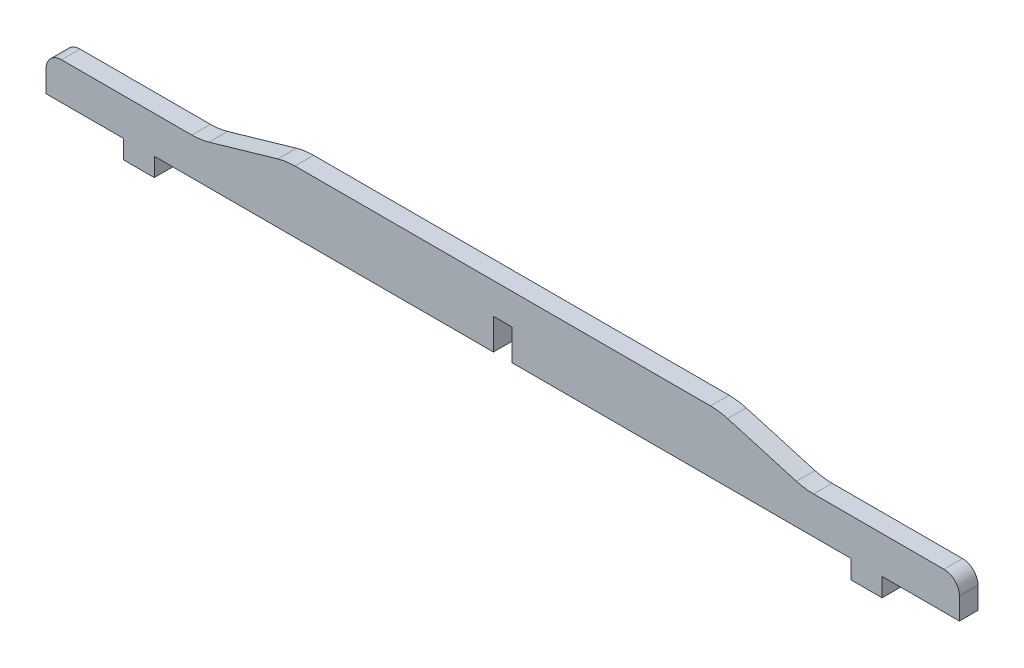
ISO-10303-21;
HEADER;
FILE_DESCRIPTION(('STEP AP214'),'2;1');
FILE_NAME('part.step','',(''),(''),'','','');
FILE_SCHEMA(('AUTOMOTIVE_DESIGN { 1 0 10303 214 1 1 1 1 }'));
ENDSEC;
DATA;
#1=APPLICATION_CONTEXT('core data for automotive mechanical design processes');
#2=APPLICATION_PROTOCOL_DEFINITION('international standard','automotive_design',2000,#1);
#3=PRODUCT_CONTEXT('',#1,'mechanical');
#4=PRODUCT('Part','Part','',(#3));
#5=PRODUCT_RELATED_PRODUCT_CATEGORY('part','',(#4));
#6=PRODUCT_DEFINITION_FORMATION('','',#4);
#7=PRODUCT_DEFINITION_CONTEXT('part definition',#1,'design');
#8=PRODUCT_DEFINITION('design','',#6,#7);
#9=PRODUCT_DEFINITION_SHAPE('','',#8);
#10=(LENGTH_UNIT() NAMED_UNIT(*) SI_UNIT(.MILLI.,.METRE.));
#11=(NAMED_UNIT(*) PLANE_ANGLE_UNIT() SI_UNIT($,.RADIAN.));
#12=(NAMED_UNIT(*) SI_UNIT($,.STERADIAN.) SOLID_ANGLE_UNIT());
#13=UNCERTAINTY_MEASURE_WITH_UNIT(LENGTH_MEASURE(1.E-05),#10,'distance_accuracy_value','');
#14=(GEOMETRIC_REPRESENTATION_CONTEXT(3) GLOBAL_UNCERTAINTY_ASSIGNED_CONTEXT((#13)) GLOBAL_UNIT_ASSIGNED_CONTEXT((#10,
#11,#12)) REPRESENTATION_CONTEXT('',''));
#15=CARTESIAN_POINT('',(0.,0.,0.));
#16=DIRECTION('',(0.,0.,1.));
#17=DIRECTION('',(1.,0.,0.));
#18=AXIS2_PLACEMENT_3D('',#15,#16,#17);
#19=CARTESIAN_POINT('',(112.66666667,-20.,6.));
#20=DIRECTION('',(0.,1.,0.));
#21=DIRECTION('',(0.,0.,1.));
#22=AXIS2_PLACEMENT_3D('',#19,#20,#21);
#23=PLANE('',#22);
#24=DIRECTION('',(1.,0.,0.));
#25=VECTOR('',#24,1.);
#26=CARTESIAN_POINT('',(112.66666667,-20.,0.));
#27=LINE('',#26,#25);
#28=CARTESIAN_POINT('',(-112.66666667,-20.,0.));
#29=VERTEX_POINT('',#28);
#30=CARTESIAN_POINT('',(-3.,-20.,0.));
#31=VERTEX_POINT('',#30);
#32=EDGE_CURVE('E228',#29,#31,#27,.T.);
#33=ORIENTED_EDGE('',*,*,#32,.T.);
#34=DIRECTION('',(0.,0.,1.));
#35=VECTOR('',#34,1.);
#36=CARTESIAN_POINT('',(-3.,-20.,0.));
#37=LINE('',#36,#35);
#38=CARTESIAN_POINT('',(-3.,-20.,6.));
#39=VERTEX_POINT('',#38);
#40=EDGE_CURVE('E211',#31,#39,#37,.T.);
#41=ORIENTED_EDGE('',*,*,#40,.T.);
#42=DIRECTION('',(1.,0.,0.));
#43=VECTOR('',#42,1.);
#44=CARTESIAN_POINT('',(112.66666667,-20.,6.));
#45=LINE('',#44,#43);
#46=CARTESIAN_POINT('',(-112.66666667,-20.,6.));
#47=VERTEX_POINT('',#46);
#48=EDGE_CURVE('E362',#47,#39,#45,.T.);
#49=ORIENTED_EDGE('',*,*,#48,.F.);
#50=DIRECTION('',(0.,0.,-1.));
#51=VECTOR('',#50,1.);
#52=CARTESIAN_POINT('',(-112.66666667,-20.,6.));
#53=LINE('',#52,#51);
#54=EDGE_CURVE('E234',#47,#29,#53,.T.);
#55=ORIENTED_EDGE('',*,*,#54,.T.);
#56=EDGE_LOOP('',(#33,#41,#49,#55));
#57=FACE_BOUND('',#56,.T.);
#58=ADVANCED_FACE('F38',(#57),#23,.F.);
#59=CARTESIAN_POINT('',(122.66666667,-26.,6.));
#60=DIRECTION('',(-1.,0.,0.));
#61=DIRECTION('',(0.,0.,1.));
#62=AXIS2_PLACEMENT_3D('',#59,#60,#61);
#63=PLANE('',#62);
#64=DIRECTION('',(0.,1.,0.));
#65=VECTOR('',#64,1.);
#66=CARTESIAN_POINT('',(122.66666667,-26.,0.));
#67=LINE('',#66,#65);
#68=CARTESIAN_POINT('',(122.66666667,-26.,0.));
#69=VERTEX_POINT('',#68);
#70=CARTESIAN_POINT('',(122.66666667,-20.,0.));
#71=VERTEX_POINT('',#70);
#72=EDGE_CURVE('E367',#69,#71,#67,.T.);
#73=ORIENTED_EDGE('',*,*,#72,.T.);
#74=DIRECTION('',(0.,0.,-1.));
#75=VECTOR('',#74,1.);
#76=CARTESIAN_POINT('',(122.66666667,-20.,6.));
#77=LINE('',#76,#75);
#78=CARTESIAN_POINT('',(122.66666667,-20.,6.));
#79=VERTEX_POINT('',#78);
#80=EDGE_CURVE('E272',#79,#71,#77,.T.);
#81=ORIENTED_EDGE('',*,*,#80,.F.);
#82=DIRECTION('',(0.,1.,0.));
#83=VECTOR('',#82,1.);
#84=CARTESIAN_POINT('',(122.66666667,-26.,6.));
#85=LINE('',#84,#83);
#86=CARTESIAN_POINT('',(122.66666667,-26.,6.));
#87=VERTEX_POINT('',#86);
#88=EDGE_CURVE('E245',#87,#79,#85,.T.);
#89=ORIENTED_EDGE('',*,*,#88,.F.);
#90=DIRECTION('',(0.,0.,-1.));
#91=VECTOR('',#90,1.);
#92=CARTESIAN_POINT('',(122.66666667,-26.,6.));
#93=LINE('',#92,#91);
#94=EDGE_CURVE('E246',#87,#69,#93,.T.);
#95=ORIENTED_EDGE('',*,*,#94,.T.);
#96=EDGE_LOOP('',(#73,#81,#89,#95));
#97=FACE_BOUND('',#96,.T.);
#98=ADVANCED_FACE('F431',(#97),#63,.F.);
#99=CARTESIAN_POINT('',(147.66666667,-20.,6.));
#100=DIRECTION('',(0.,1.,0.));
#101=DIRECTION('',(0.,0.,1.));
#102=AXIS2_PLACEMENT_3D('',#99,#100,#101);
#103=PLANE('',#102);
#104=DIRECTION('',(1.,0.,0.));
#105=VECTOR('',#104,1.);
#106=CARTESIAN_POINT('',(147.66666667,-20.,0.));
#107=LINE('',#106,#105);
#108=CARTESIAN_POINT('',(147.66666667,-20.,0.));
#109=VERTEX_POINT('',#108);
#110=EDGE_CURVE('E370',#71,#109,#107,.T.);
#111=ORIENTED_EDGE('',*,*,#110,.T.);
#112=DIRECTION('',(0.,0.,-1.));
#113=VECTOR('',#112,1.);
#114=CARTESIAN_POINT('',(147.66666667,-20.,6.));
#115=LINE('',#114,#113);
#116=CARTESIAN_POINT('',(147.66666667,-20.,6.));
#117=VERTEX_POINT('',#116);
#118=EDGE_CURVE('E269',#117,#109,#115,.T.);
#119=ORIENTED_EDGE('',*,*,#118,.F.);
#120=DIRECTION('',(1.,0.,0.));
#121=VECTOR('',#120,1.);
#122=CARTESIAN_POINT('',(147.66666667,-20.,6.));
#123=LINE('',#122,#121);
#124=EDGE_CURVE('E472',#79,#117,#123,.T.);
#125=ORIENTED_EDGE('',*,*,#124,.F.);
#126=ORIENTED_EDGE('',*,*,#80,.T.);
#127=EDGE_LOOP('',(#111,#119,#125,#126));
#128=FACE_BOUND('',#127,.T.);
#129=ADVANCED_FACE('F437',(#128),#103,.F.);
#130=CARTESIAN_POINT('',(147.66666667,-8.00000000000002,6.));
#131=DIRECTION('',(-1.,0.,0.));
#132=DIRECTION('',(0.,-1.,0.));
#133=AXIS2_PLACEMENT_3D('',#130,#131,#132);
#134=PLANE('',#133);
#135=DIRECTION('',(0.,1.,0.));
#136=VECTOR('',#135,1.);
#137=CARTESIAN_POINT('',(147.66666667,-8.00000000000002,0.));
#138=LINE('',#137,#136);
#139=CARTESIAN_POINT('',(147.66666667,-13.,0.));
#140=VERTEX_POINT('',#139);
#141=EDGE_CURVE('E372',#109,#140,#138,.T.);
#142=ORIENTED_EDGE('',*,*,#141,.T.);
#143=DIRECTION('',(0.,0.,-1.));
#144=VECTOR('',#143,1.);
#145=CARTESIAN_POINT('',(147.66666667,-13.,6.));
#146=LINE('',#145,#144);
#147=CARTESIAN_POINT('',(147.66666667,-13.,6.));
#148=VERTEX_POINT('',#147);
#149=EDGE_CURVE('E283',#140,#148,#146,.F.);
#150=ORIENTED_EDGE('',*,*,#149,.T.);
#151=DIRECTION('',(0.,1.,0.));
#152=VECTOR('',#151,1.);
#153=CARTESIAN_POINT('',(147.66666667,-8.00000000000002,6.));
#154=LINE('',#153,#152);
#155=EDGE_CURVE('E474',#117,#148,#154,.T.);
#156=ORIENTED_EDGE('',*,*,#155,.F.);
#157=ORIENTED_EDGE('',*,*,#118,.T.);
#158=EDGE_LOOP('',(#142,#150,#156,#157));
#159=FACE_BOUND('',#158,.T.);
#160=ADVANCED_FACE('F511',(#159),#134,.F.);
#161=CARTESIAN_POINT('',(97.66666667,-8.00000000000002,6.));
#162=DIRECTION('',(0.,-1.,0.));
#163=DIRECTION('',(1.,0.,0.));
#164=AXIS2_PLACEMENT_3D('',#161,#162,#163);
#165=PLANE('',#164);
#166=DIRECTION('',(-1.,0.,0.));
#167=VECTOR('',#166,1.);
#168=CARTESIAN_POINT('',(97.66666667,-8.00000000000002,0.));
#169=LINE('',#168,#167);
#170=CARTESIAN_POINT('',(142.66666667,-8.00000000000002,0.));
#171=VERTEX_POINT('',#170);
#172=CARTESIAN_POINT('',(100.500192903982,-8.00000000000002,0.));
#173=VERTEX_POINT('',#172);
#174=EDGE_CURVE('E375',#171,#173,#169,.T.);
#175=ORIENTED_EDGE('',*,*,#174,.T.);
#176=DIRECTION('',(0.,0.,-1.));
#177=VECTOR('',#176,1.);
#178=CARTESIAN_POINT('',(100.500192903982,-8.00000000000002,6.));
#179=LINE('',#178,#177);
#180=CARTESIAN_POINT('',(100.500192903982,-8.00000000000002,6.));
#181=VERTEX_POINT('',#180);
#182=EDGE_CURVE('E300',#173,#181,#179,.F.);
#183=ORIENTED_EDGE('',*,*,#182,.T.);
#184=DIRECTION('',(-1.,0.,0.));
#185=VECTOR('',#184,1.);
#186=CARTESIAN_POINT('',(97.66666667,-8.00000000000002,6.));
#187=LINE('',#186,#185);
#188=CARTESIAN_POINT('',(142.66666667,-8.00000000000002,6.));
#189=VERTEX_POINT('',#188);
#190=EDGE_CURVE('E477',#189,#181,#187,.T.);
#191=ORIENTED_EDGE('',*,*,#190,.F.);
#192=DIRECTION('',(0.,0.,-1.));
#193=VECTOR('',#192,1.);
#194=CARTESIAN_POINT('',(142.66666667,-8.00000000000002,6.));
#195=LINE('',#194,#193);
#196=EDGE_CURVE('E275',#189,#171,#195,.T.);
#197=ORIENTED_EDGE('',*,*,#196,.T.);
#198=EDGE_LOOP('',(#175,#183,#191,#197));
#199=FACE_BOUND('',#198,.T.);
#200=ADVANCED_FACE('F504',(#199),#165,.F.);
#201=CARTESIAN_POINT('',(70.,0.,6.));
#202=DIRECTION('',(-0.277777033532158,-0.960645574414453,0.));
#203=DIRECTION('',(0.960645574414453,-0.277777033532158,0.));
#204=AXIS2_PLACEMENT_3D('',#201,#202,#203);
#205=PLANE('',#204);
#206=DIRECTION('',(-0.960645574414453,0.277777033532158,0.));
#207=VECTOR('',#206,1.);
#208=CARTESIAN_POINT('',(70.,0.,6.));
#209=LINE('',#208,#207);
#210=CARTESIAN_POINT('',(94.9446522333384,-7.21291148828908,6.));
#211=VERTEX_POINT('',#210);
#212=CARTESIAN_POINT('',(72.7220144366616,-0.787088511710961,6.));
#213=VERTEX_POINT('',#212);
#214=EDGE_CURVE('E480',#211,#213,#209,.T.);
#215=ORIENTED_EDGE('',*,*,#214,.F.);
#216=DIRECTION('',(0.,0.,-1.));
#217=VECTOR('',#216,1.);
#218=CARTESIAN_POINT('',(94.9446522333384,-7.21291148828908,0.));
#219=LINE('',#218,#217);
#220=CARTESIAN_POINT('',(94.9446522333384,-7.21291148828908,0.));
#221=VERTEX_POINT('',#220);
#222=EDGE_CURVE('E297',#211,#221,#219,.T.);
#223=ORIENTED_EDGE('',*,*,#222,.T.);
#224=DIRECTION('',(-0.960645574414453,0.277777033532158,0.));
#225=VECTOR('',#224,1.);
#226=CARTESIAN_POINT('',(70.,0.,0.));
#227=LINE('',#226,#225);
#228=CARTESIAN_POINT('',(72.7220144366616,-0.787088511710961,0.));
#229=VERTEX_POINT('',#228);
#230=EDGE_CURVE('E378',#221,#229,#227,.T.);
#231=ORIENTED_EDGE('',*,*,#230,.T.);
#232=DIRECTION('',(0.,0.,-1.));
#233=VECTOR('',#232,1.);
#234=CARTESIAN_POINT('',(72.7220144366616,-0.787088511710961,6.));
#235=LINE('',#234,#233);
#236=EDGE_CURVE('E295',#229,#213,#235,.F.);
#237=ORIENTED_EDGE('',*,*,#236,.T.);
#238=EDGE_LOOP('',(#215,#223,#231,#237));
#239=FACE_BOUND('',#238,.T.);
#240=ADVANCED_FACE('F498',(#239),#205,.F.);
#241=CARTESIAN_POINT('',(70.,0.,6.));
#242=DIRECTION('',(0.,-1.,0.));
#243=DIRECTION('',(0.,0.,-1.));
#244=AXIS2_PLACEMENT_3D('',#241,#242,#243);
#245=PLANE('',#244);
#246=DIRECTION('',(-1.,0.,0.));
#247=VECTOR('',#246,1.);
#248=CARTESIAN_POINT('',(70.,0.,6.));
#249=LINE('',#248,#247);
#250=CARTESIAN_POINT('',(67.1664737660185,0.,6.));
#251=VERTEX_POINT('',#250);
#252=CARTESIAN_POINT('',(-67.1664737660185,0.,6.));
#253=VERTEX_POINT('',#252);
#254=EDGE_CURVE('E350',#251,#253,#249,.T.);
#255=ORIENTED_EDGE('',*,*,#254,.F.);
#256=DIRECTION('',(0.,0.,-1.));
#257=VECTOR('',#256,1.);
#258=CARTESIAN_POINT('',(67.1664737660185,0.,6.));
#259=LINE('',#258,#257);
#260=CARTESIAN_POINT('',(67.1664737660185,0.,0.));
#261=VERTEX_POINT('',#260);
#262=EDGE_CURVE('E304',#251,#261,#259,.T.);
#263=ORIENTED_EDGE('',*,*,#262,.T.);
#264=DIRECTION('',(-1.,0.,0.));
#265=VECTOR('',#264,1.);
#266=CARTESIAN_POINT('',(70.,0.,0.));
#267=LINE('',#266,#265);
#268=CARTESIAN_POINT('',(-67.1664737660185,0.,0.));
#269=VERTEX_POINT('',#268);
#270=EDGE_CURVE('E338',#261,#269,#267,.T.);
#271=ORIENTED_EDGE('',*,*,#270,.T.);
#272=DIRECTION('',(0.,0.,-1.));
#273=VECTOR('',#272,1.);
#274=CARTESIAN_POINT('',(-67.1664737660185,0.,6.));
#275=LINE('',#274,#273);
#276=EDGE_CURVE('E302',#269,#253,#275,.F.);
#277=ORIENTED_EDGE('',*,*,#276,.T.);
#278=EDGE_LOOP('',(#255,#263,#271,#277));
#279=FACE_BOUND('',#278,.T.);
#280=ADVANCED_FACE('F492',(#279),#245,.F.);
#281=CARTESIAN_POINT('',(-97.66666667,-8.00000000000002,6.));
#282=DIRECTION('',(0.277777033532158,-0.960645574414453,0.));
#283=DIRECTION('',(0.960645574414453,0.277777033532158,0.));
#284=AXIS2_PLACEMENT_3D('',#281,#282,#283);
#285=PLANE('',#284);
#286=DIRECTION('',(-0.960645574414453,-0.277777033532158,0.));
#287=VECTOR('',#286,1.);
#288=CARTESIAN_POINT('',(-97.66666667,-8.00000000000002,6.));
#289=LINE('',#288,#287);
#290=CARTESIAN_POINT('',(-72.7220144366616,-0.787088511710957,6.));
#291=VERTEX_POINT('',#290);
#292=CARTESIAN_POINT('',(-94.9446522333383,-7.21291148828908,6.));
#293=VERTEX_POINT('',#292);
#294=EDGE_CURVE('E346',#291,#293,#289,.T.);
#295=ORIENTED_EDGE('',*,*,#294,.F.);
#296=DIRECTION('',(0.,0.,-1.));
#297=VECTOR('',#296,1.);
#298=CARTESIAN_POINT('',(-72.7220144366616,-0.787088511710958,6.));
#299=LINE('',#298,#297);
#300=CARTESIAN_POINT('',(-72.7220144366616,-0.787088511710957,0.));
#301=VERTEX_POINT('',#300);
#302=EDGE_CURVE('E317',#291,#301,#299,.T.);
#303=ORIENTED_EDGE('',*,*,#302,.T.);
#304=DIRECTION('',(-0.960645574414453,-0.277777033532158,0.));
#305=VECTOR('',#304,1.);
#306=CARTESIAN_POINT('',(-97.66666667,-8.00000000000002,0.));
#307=LINE('',#306,#305);
#308=CARTESIAN_POINT('',(-94.9446522333383,-7.21291148828908,0.));
#309=VERTEX_POINT('',#308);
#310=EDGE_CURVE('E329',#301,#309,#307,.T.);
#311=ORIENTED_EDGE('',*,*,#310,.T.);
#312=DIRECTION('',(0.,0.,-1.));
#313=VECTOR('',#312,1.);
#314=CARTESIAN_POINT('',(-94.9446522333383,-7.21291148828908,6.));
#315=LINE('',#314,#313);
#316=EDGE_CURVE('E315',#309,#293,#315,.F.);
#317=ORIENTED_EDGE('',*,*,#316,.T.);
#318=EDGE_LOOP('',(#295,#303,#311,#317));
#319=FACE_BOUND('',#318,.T.);
#320=ADVANCED_FACE('F336',(#319),#285,.F.);
#321=CARTESIAN_POINT('',(-147.66666667,-8.00000000000002,6.));
#322=DIRECTION('',(0.,-1.,0.));
#323=DIRECTION('',(1.,0.,0.));
#324=AXIS2_PLACEMENT_3D('',#321,#322,#323);
#325=PLANE('',#324);
#326=DIRECTION('',(-1.,0.,0.));
#327=VECTOR('',#326,1.);
#328=CARTESIAN_POINT('',(-147.66666667,-8.00000000000002,6.));
#329=LINE('',#328,#327);
#330=CARTESIAN_POINT('',(-100.500192903981,-8.00000000000002,6.));
#331=VERTEX_POINT('',#330);
#332=CARTESIAN_POINT('',(-142.66666667,-8.00000000000002,6.));
#333=VERTEX_POINT('',#332);
#334=EDGE_CURVE('E342',#331,#333,#329,.T.);
#335=ORIENTED_EDGE('',*,*,#334,.F.);
#336=DIRECTION('',(0.,0.,-1.));
#337=VECTOR('',#336,1.);
#338=CARTESIAN_POINT('',(-100.500192903981,-8.00000000000003,0.));
#339=LINE('',#338,#337);
#340=CARTESIAN_POINT('',(-100.500192903981,-8.00000000000002,0.));
#341=VERTEX_POINT('',#340);
#342=EDGE_CURVE('E320',#331,#341,#339,.T.);
#343=ORIENTED_EDGE('',*,*,#342,.T.);
#344=DIRECTION('',(-1.,0.,0.));
#345=VECTOR('',#344,1.);
#346=CARTESIAN_POINT('',(-147.66666667,-8.00000000000002,0.));
#347=LINE('',#346,#345);
#348=CARTESIAN_POINT('',(-142.66666667,-8.00000000000002,0.));
#349=VERTEX_POINT('',#348);
#350=EDGE_CURVE('E330',#341,#349,#347,.T.);
#351=ORIENTED_EDGE('',*,*,#350,.T.);
#352=DIRECTION('',(0.,0.,-1.));
#353=VECTOR('',#352,1.);
#354=CARTESIAN_POINT('',(-142.66666667,-8.00000000000002,6.));
#355=LINE('',#354,#353);
#356=EDGE_CURVE('E292',#349,#333,#355,.F.);
#357=ORIENTED_EDGE('',*,*,#356,.T.);
#358=EDGE_LOOP('',(#335,#343,#351,#357));
#359=FACE_BOUND('',#358,.T.);
#360=ADVANCED_FACE('F341',(#359),#325,.F.);
#361=CARTESIAN_POINT('',(-147.66666667,-20.,6.));
#362=DIRECTION('',(1.,0.,0.));
#363=DIRECTION('',(0.,1.,0.));
#364=AXIS2_PLACEMENT_3D('',#361,#362,#363);
#365=PLANE('',#364);
#366=DIRECTION('',(0.,-1.,0.));
#367=VECTOR('',#366,1.);
#368=CARTESIAN_POINT('',(-147.66666667,-20.,6.));
#369=LINE('',#368,#367);
#370=CARTESIAN_POINT('',(-147.66666667,-13.,6.));
#371=VERTEX_POINT('',#370);
#372=CARTESIAN_POINT('',(-147.66666667,-20.,6.));
#373=VERTEX_POINT('',#372);
#374=EDGE_CURVE('E345',#371,#373,#369,.T.);
#375=ORIENTED_EDGE('',*,*,#374,.F.);
#376=DIRECTION('',(0.,0.,-1.));
#377=VECTOR('',#376,1.);
#378=CARTESIAN_POINT('',(-147.66666667,-13.,6.));
#379=LINE('',#378,#377);
#380=CARTESIAN_POINT('',(-147.66666667,-13.,0.));
#381=VERTEX_POINT('',#380);
#382=EDGE_CURVE('E289',#371,#381,#379,.T.);
#383=ORIENTED_EDGE('',*,*,#382,.T.);
#384=DIRECTION('',(0.,-1.,0.));
#385=VECTOR('',#384,1.);
#386=CARTESIAN_POINT('',(-147.66666667,-20.,0.));
#387=LINE('',#386,#385);
#388=CARTESIAN_POINT('',(-147.66666667,-20.,0.));
#389=VERTEX_POINT('',#388);
#390=EDGE_CURVE('E384',#381,#389,#387,.T.);
#391=ORIENTED_EDGE('',*,*,#390,.T.);
#392=DIRECTION('',(0.,0.,-1.));
#393=VECTOR('',#392,1.);
#394=CARTESIAN_POINT('',(-147.66666667,-20.,6.));
#395=LINE('',#394,#393);
#396=EDGE_CURVE('E266',#373,#389,#395,.T.);
#397=ORIENTED_EDGE('',*,*,#396,.F.);
#398=EDGE_LOOP('',(#375,#383,#391,#397));
#399=FACE_BOUND('',#398,.T.);
#400=ADVANCED_FACE('F413',(#399),#365,.F.);
#401=CARTESIAN_POINT('',(-147.66666667,-20.,6.));
#402=DIRECTION('',(0.,1.,0.));
#403=DIRECTION('',(0.,0.,1.));
#404=AXIS2_PLACEMENT_3D('',#401,#402,#403);
#405=PLANE('',#404);
#406=DIRECTION('',(1.,0.,0.));
#407=VECTOR('',#406,1.);
#408=CARTESIAN_POINT('',(-147.66666667,-20.,0.));
#409=LINE('',#408,#407);
#410=CARTESIAN_POINT('',(-122.66666667,-20.,0.));
#411=VERTEX_POINT('',#410);
#412=EDGE_CURVE('E386',#389,#411,#409,.T.);
#413=ORIENTED_EDGE('',*,*,#412,.T.);
#414=DIRECTION('',(0.,0.,-1.));
#415=VECTOR('',#414,1.);
#416=CARTESIAN_POINT('',(-122.66666667,-20.,6.));
#417=LINE('',#416,#415);
#418=CARTESIAN_POINT('',(-122.66666667,-20.,6.));
#419=VERTEX_POINT('',#418);
#420=EDGE_CURVE('E263',#419,#411,#417,.T.);
#421=ORIENTED_EDGE('',*,*,#420,.F.);
#422=DIRECTION('',(1.,0.,0.));
#423=VECTOR('',#422,1.);
#424=CARTESIAN_POINT('',(-147.66666667,-20.,6.));
#425=LINE('',#424,#423);
#426=EDGE_CURVE('E348',#373,#419,#425,.T.);
#427=ORIENTED_EDGE('',*,*,#426,.F.);
#428=ORIENTED_EDGE('',*,*,#396,.T.);
#429=EDGE_LOOP('',(#413,#421,#427,#428));
#430=FACE_BOUND('',#429,.T.);
#431=ADVANCED_FACE('F411',(#430),#405,.F.);
#432=CARTESIAN_POINT('',(-122.66666667,-20.,6.));
#433=DIRECTION('',(1.,0.,0.));
#434=DIRECTION('',(0.,0.,-1.));
#435=AXIS2_PLACEMENT_3D('',#432,#433,#434);
#436=PLANE('',#435);
#437=DIRECTION('',(0.,-1.,0.));
#438=VECTOR('',#437,1.);
#439=CARTESIAN_POINT('',(-122.66666667,-20.,0.));
#440=LINE('',#439,#438);
#441=CARTESIAN_POINT('',(-122.66666667,-26.,0.));
#442=VERTEX_POINT('',#441);
#443=EDGE_CURVE('E388',#411,#442,#440,.T.);
#444=ORIENTED_EDGE('',*,*,#443,.T.);
#445=DIRECTION('',(0.,0.,-1.));
#446=VECTOR('',#445,1.);
#447=CARTESIAN_POINT('',(-122.66666667,-26.,6.));
#448=LINE('',#447,#446);
#449=CARTESIAN_POINT('',(-122.66666667,-26.,6.));
#450=VERTEX_POINT('',#449);
#451=EDGE_CURVE('E260',#450,#442,#448,.T.);
#452=ORIENTED_EDGE('',*,*,#451,.F.);
#453=DIRECTION('',(0.,-1.,0.));
#454=VECTOR('',#453,1.);
#455=CARTESIAN_POINT('',(-122.66666667,-20.,6.));
#456=LINE('',#455,#454);
#457=EDGE_CURVE('E355',#419,#450,#456,.T.);
#458=ORIENTED_EDGE('',*,*,#457,.F.);
#459=ORIENTED_EDGE('',*,*,#420,.T.);
#460=EDGE_LOOP('',(#444,#452,#458,#459));
#461=FACE_BOUND('',#460,.T.);
#462=ADVANCED_FACE('F401',(#461),#436,.F.);
#463=CARTESIAN_POINT('',(-122.66666667,-26.,6.));
#464=DIRECTION('',(0.,1.,0.));
#465=DIRECTION('',(0.,0.,1.));
#466=AXIS2_PLACEMENT_3D('',#463,#464,#465);
#467=PLANE('',#466);
#468=DIRECTION('',(1.,0.,0.));
#469=VECTOR('',#468,1.);
#470=CARTESIAN_POINT('',(-122.66666667,-26.,0.));
#471=LINE('',#470,#469);
#472=CARTESIAN_POINT('',(-112.66666667,-26.,0.));
#473=VERTEX_POINT('',#472);
#474=EDGE_CURVE('E389',#442,#473,#471,.T.);
#475=ORIENTED_EDGE('',*,*,#474,.T.);
#476=DIRECTION('',(0.,0.,-1.));
#477=VECTOR('',#476,1.);
#478=CARTESIAN_POINT('',(-112.66666667,-26.,6.));
#479=LINE('',#478,#477);
#480=CARTESIAN_POINT('',(-112.66666667,-26.,6.));
#481=VERTEX_POINT('',#480);
#482=EDGE_CURVE('E257',#481,#473,#479,.T.);
#483=ORIENTED_EDGE('',*,*,#482,.F.);
#484=DIRECTION('',(1.,0.,0.));
#485=VECTOR('',#484,1.);
#486=CARTESIAN_POINT('',(-122.66666667,-26.,6.));
#487=LINE('',#486,#485);
#488=EDGE_CURVE('E357',#450,#481,#487,.T.);
#489=ORIENTED_EDGE('',*,*,#488,.F.);
#490=ORIENTED_EDGE('',*,*,#451,.T.);
#491=EDGE_LOOP('',(#475,#483,#489,#490));
#492=FACE_BOUND('',#491,.T.);
#493=ADVANCED_FACE('F405',(#492),#467,.F.);
#494=CARTESIAN_POINT('',(-112.66666667,-26.,6.));
#495=DIRECTION('',(-1.,0.,0.));
#496=DIRECTION('',(0.,0.,1.));
#497=AXIS2_PLACEMENT_3D('',#494,#495,#496);
#498=PLANE('',#497);
#499=DIRECTION('',(0.,1.,0.));
#500=VECTOR('',#499,1.);
#501=CARTESIAN_POINT('',(-112.66666667,-26.,0.));
#502=LINE('',#501,#500);
#503=EDGE_CURVE('E240',#473,#29,#502,.T.);
#504=ORIENTED_EDGE('',*,*,#503,.T.);
#505=ORIENTED_EDGE('',*,*,#54,.F.);
#506=DIRECTION('',(0.,1.,0.));
#507=VECTOR('',#506,1.);
#508=CARTESIAN_POINT('',(-112.66666667,-26.,6.));
#509=LINE('',#508,#507);
#510=EDGE_CURVE('E359',#481,#47,#509,.T.);
#511=ORIENTED_EDGE('',*,*,#510,.F.);
#512=ORIENTED_EDGE('',*,*,#482,.T.);
#513=EDGE_LOOP('',(#504,#505,#511,#512));
#514=FACE_BOUND('',#513,.T.);
#515=ADVANCED_FACE('F394',(#514),#498,.F.);
#516=CARTESIAN_POINT('',(3.,-20.,6.));
#517=VERTEX_POINT('',#516);
#518=CARTESIAN_POINT('',(112.66666667,-20.,6.));
#519=VERTEX_POINT('',#518);
#520=EDGE_CURVE('E361',#517,#519,#45,.T.);
#521=ORIENTED_EDGE('',*,*,#520,.F.);
#522=DIRECTION('',(0.,0.,1.));
#523=VECTOR('',#522,1.);
#524=CARTESIAN_POINT('',(3.,-20.,0.));
#525=LINE('',#524,#523);
#526=CARTESIAN_POINT('',(3.,-20.,0.));
#527=VERTEX_POINT('',#526);
#528=EDGE_CURVE('E222',#527,#517,#525,.T.);
#529=ORIENTED_EDGE('',*,*,#528,.F.);
#530=CARTESIAN_POINT('',(112.66666667,-20.,0.));
#531=VERTEX_POINT('',#530);
#532=EDGE_CURVE('E236',#527,#531,#27,.T.);
#533=ORIENTED_EDGE('',*,*,#532,.T.);
#534=DIRECTION('',(0.,0.,-1.));
#535=VECTOR('',#534,1.);
#536=CARTESIAN_POINT('',(112.66666667,-20.,6.));
#537=LINE('',#536,#535);
#538=EDGE_CURVE('E253',#519,#531,#537,.T.);
#539=ORIENTED_EDGE('',*,*,#538,.F.);
#540=EDGE_LOOP('',(#521,#529,#533,#539));
#541=FACE_BOUND('',#540,.T.);
#542=ADVANCED_FACE('F433',(#541),#23,.F.);
#543=CARTESIAN_POINT('',(112.66666667,-20.,6.));
#544=DIRECTION('',(1.,0.,0.));
#545=DIRECTION('',(0.,0.,-1.));
#546=AXIS2_PLACEMENT_3D('',#543,#544,#545);
#547=PLANE('',#546);
#548=DIRECTION('',(0.,-1.,0.));
#549=VECTOR('',#548,1.);
#550=CARTESIAN_POINT('',(112.66666667,-20.,0.));
#551=LINE('',#550,#549);
#552=CARTESIAN_POINT('',(112.66666667,-26.,0.));
#553=VERTEX_POINT('',#552);
#554=EDGE_CURVE('E235',#531,#553,#551,.T.);
#555=ORIENTED_EDGE('',*,*,#554,.T.);
#556=DIRECTION('',(0.,0.,-1.));
#557=VECTOR('',#556,1.);
#558=CARTESIAN_POINT('',(112.66666667,-26.,6.));
#559=LINE('',#558,#557);
#560=CARTESIAN_POINT('',(112.66666667,-26.,6.));
#561=VERTEX_POINT('',#560);
#562=EDGE_CURVE('E249',#561,#553,#559,.T.);
#563=ORIENTED_EDGE('',*,*,#562,.F.);
#564=DIRECTION('',(0.,-1.,0.));
#565=VECTOR('',#564,1.);
#566=CARTESIAN_POINT('',(112.66666667,-20.,6.));
#567=LINE('',#566,#565);
#568=EDGE_CURVE('E364',#519,#561,#567,.T.);
#569=ORIENTED_EDGE('',*,*,#568,.F.);
#570=ORIENTED_EDGE('',*,*,#538,.T.);
#571=EDGE_LOOP('',(#555,#563,#569,#570));
#572=FACE_BOUND('',#571,.T.);
#573=ADVANCED_FACE('F443',(#572),#547,.F.);
#574=CARTESIAN_POINT('',(112.66666667,-26.,6.));
#575=DIRECTION('',(0.,1.,0.));
#576=DIRECTION('',(0.,0.,1.));
#577=AXIS2_PLACEMENT_3D('',#574,#575,#576);
#578=PLANE('',#577);
#579=DIRECTION('',(1.,0.,0.));
#580=VECTOR('',#579,1.);
#581=CARTESIAN_POINT('',(112.66666667,-26.,0.));
#582=LINE('',#581,#580);
#583=EDGE_CURVE('E238',#553,#69,#582,.T.);
#584=ORIENTED_EDGE('',*,*,#583,.T.);
#585=ORIENTED_EDGE('',*,*,#94,.F.);
#586=DIRECTION('',(1.,0.,0.));
#587=VECTOR('',#586,1.);
#588=CARTESIAN_POINT('',(112.66666667,-26.,6.));
#589=LINE('',#588,#587);
#590=EDGE_CURVE('E250',#561,#87,#589,.T.);
#591=ORIENTED_EDGE('',*,*,#590,.F.);
#592=ORIENTED_EDGE('',*,*,#562,.T.);
#593=EDGE_LOOP('',(#584,#585,#591,#592));
#594=FACE_BOUND('',#593,.T.);
#595=ADVANCED_FACE('F449',(#594),#578,.F.);
#596=CARTESIAN_POINT('',(0.,0.,6.));
#597=DIRECTION('',(0.,0.,1.));
#598=DIRECTION('',(1.,0.,0.));
#599=AXIS2_PLACEMENT_3D('',#596,#597,#598);
#600=PLANE('',#599);
#601=DIRECTION('',(0.,-1.,0.));
#602=VECTOR('',#601,1.);
#603=CARTESIAN_POINT('',(-3.,0.,6.));
#604=LINE('',#603,#602);
#605=CARTESIAN_POINT('',(-3.,-10.,6.));
#606=VERTEX_POINT('',#605);
#607=EDGE_CURVE('E217',#606,#39,#604,.T.);
#608=ORIENTED_EDGE('',*,*,#607,.F.);
#609=DIRECTION('',(-1.,0.,0.));
#610=VECTOR('',#609,1.);
#611=CARTESIAN_POINT('',(0.,-10.,6.));
#612=LINE('',#611,#610);
#613=CARTESIAN_POINT('',(3.,-10.,6.));
#614=VERTEX_POINT('',#613);
#615=EDGE_CURVE('E460',#614,#606,#612,.T.);
#616=ORIENTED_EDGE('',*,*,#615,.F.);
#617=DIRECTION('',(0.,1.,0.));
#618=VECTOR('',#617,1.);
#619=CARTESIAN_POINT('',(3.,0.,6.));
#620=LINE('',#619,#618);
#621=EDGE_CURVE('E459',#517,#614,#620,.T.);
#622=ORIENTED_EDGE('',*,*,#621,.F.);
#623=ORIENTED_EDGE('',*,*,#520,.T.);
#624=ORIENTED_EDGE('',*,*,#568,.T.);
#625=ORIENTED_EDGE('',*,*,#590,.T.);
#626=ORIENTED_EDGE('',*,*,#88,.T.);
#627=ORIENTED_EDGE('',*,*,#124,.T.);
#628=ORIENTED_EDGE('',*,*,#155,.T.);
#629=CARTESIAN_POINT('',(142.66666667,-13.,6.));
#630=DIRECTION('',(0.,0.,1.));
#631=DIRECTION('',(1.,0.,0.));
#632=AXIS2_PLACEMENT_3D('',#629,#630,#631);
#633=CIRCLE('',#632,5.);
#634=EDGE_CURVE('E287',#148,#189,#633,.T.);
#635=ORIENTED_EDGE('',*,*,#634,.T.);
#636=ORIENTED_EDGE('',*,*,#190,.T.);
#637=CARTESIAN_POINT('',(100.500192903982,12.,6.));
#638=DIRECTION('',(0.,0.,1.));
#639=DIRECTION('',(1.,0.,0.));
#640=AXIS2_PLACEMENT_3D('',#637,#638,#639);
#641=CIRCLE('',#640,20.);
#642=EDGE_CURVE('E325',#181,#211,#641,.F.);
#643=ORIENTED_EDGE('',*,*,#642,.T.);
#644=ORIENTED_EDGE('',*,*,#214,.T.);
#645=CARTESIAN_POINT('',(67.1664737660185,-20.,6.));
#646=DIRECTION('',(0.,0.,1.));
#647=DIRECTION('',(1.,0.,0.));
#648=AXIS2_PLACEMENT_3D('',#645,#646,#647);
#649=CIRCLE('',#648,20.);
#650=EDGE_CURVE('E313',#213,#251,#649,.T.);
#651=ORIENTED_EDGE('',*,*,#650,.T.);
#652=ORIENTED_EDGE('',*,*,#254,.T.);
#653=CARTESIAN_POINT('',(-67.1664737660185,-20.,6.));
#654=DIRECTION('',(0.,0.,1.));
#655=DIRECTION('',(1.,0.,0.));
#656=AXIS2_PLACEMENT_3D('',#653,#654,#655);
#657=CIRCLE('',#656,20.);
#658=EDGE_CURVE('E311',#253,#291,#657,.T.);
#659=ORIENTED_EDGE('',*,*,#658,.T.);
#660=ORIENTED_EDGE('',*,*,#294,.T.);
#661=CARTESIAN_POINT('',(-100.500192903981,12.,6.));
#662=DIRECTION('',(0.,0.,1.));
#663=DIRECTION('',(1.,0.,0.));
#664=AXIS2_PLACEMENT_3D('',#661,#662,#663);
#665=CIRCLE('',#664,20.);
#666=EDGE_CURVE('E11',#293,#331,#665,.F.);
#667=ORIENTED_EDGE('',*,*,#666,.T.);
#668=ORIENTED_EDGE('',*,*,#334,.T.);
#669=CARTESIAN_POINT('',(-142.66666667,-13.,6.));
#670=DIRECTION('',(0.,0.,1.));
#671=DIRECTION('',(1.,0.,0.));
#672=AXIS2_PLACEMENT_3D('',#669,#670,#671);
#673=CIRCLE('',#672,5.);
#674=EDGE_CURVE('E285',#333,#371,#673,.T.);
#675=ORIENTED_EDGE('',*,*,#674,.T.);
#676=ORIENTED_EDGE('',*,*,#374,.T.);
#677=ORIENTED_EDGE('',*,*,#426,.T.);
#678=ORIENTED_EDGE('',*,*,#457,.T.);
#679=ORIENTED_EDGE('',*,*,#488,.T.);
#680=ORIENTED_EDGE('',*,*,#510,.T.);
#681=ORIENTED_EDGE('',*,*,#48,.T.);
#682=EDGE_LOOP('',(#608,#616,#622,#623,#624,#625,#626,#627,#628,#635,#636,#643,#644,#651,#652,
#659,#660,#667,#668,#675,#676,#677,#678,#679,#680,#681));
#683=FACE_BOUND('',#682,.T.);
#684=ADVANCED_FACE('F406',(#683),#600,.T.);
#685=CARTESIAN_POINT('',(0.,0.,0.));
#686=DIRECTION('',(0.,0.,1.));
#687=DIRECTION('',(1.,0.,0.));
#688=AXIS2_PLACEMENT_3D('',#685,#686,#687);
#689=PLANE('',#688);
#690=DIRECTION('',(-1.,0.,0.));
#691=VECTOR('',#690,1.);
#692=CARTESIAN_POINT('',(-3.,-10.,0.));
#693=LINE('',#692,#691);
#694=CARTESIAN_POINT('',(3.,-10.,0.));
#695=VERTEX_POINT('',#694);
#696=CARTESIAN_POINT('',(-3.,-10.,0.));
#697=VERTEX_POINT('',#696);
#698=EDGE_CURVE('E53',#695,#697,#693,.T.);
#699=ORIENTED_EDGE('',*,*,#698,.T.);
#700=DIRECTION('',(0.,-1.,0.));
#701=VECTOR('',#700,1.);
#702=CARTESIAN_POINT('',(-3.,-20.,0.));
#703=LINE('',#702,#701);
#704=EDGE_CURVE('E215',#697,#31,#703,.T.);
#705=ORIENTED_EDGE('',*,*,#704,.T.);
#706=ORIENTED_EDGE('',*,*,#32,.F.);
#707=ORIENTED_EDGE('',*,*,#503,.F.);
#708=ORIENTED_EDGE('',*,*,#474,.F.);
#709=ORIENTED_EDGE('',*,*,#443,.F.);
#710=ORIENTED_EDGE('',*,*,#412,.F.);
#711=ORIENTED_EDGE('',*,*,#390,.F.);
#712=CARTESIAN_POINT('',(-142.66666667,-13.,0.));
#713=DIRECTION('',(0.,0.,1.));
#714=DIRECTION('',(1.,0.,0.));
#715=AXIS2_PLACEMENT_3D('',#712,#713,#714);
#716=CIRCLE('',#715,5.);
#717=EDGE_CURVE('E278',#381,#349,#716,.F.);
#718=ORIENTED_EDGE('',*,*,#717,.T.);
#719=ORIENTED_EDGE('',*,*,#350,.F.);
#720=CARTESIAN_POINT('',(-100.500192903981,12.,0.));
#721=DIRECTION('',(0.,0.,1.));
#722=DIRECTION('',(1.,0.,0.));
#723=AXIS2_PLACEMENT_3D('',#720,#721,#722);
#724=CIRCLE('',#723,20.);
#725=EDGE_CURVE('E46',#341,#309,#724,.T.);
#726=ORIENTED_EDGE('',*,*,#725,.T.);
#727=ORIENTED_EDGE('',*,*,#310,.F.);
#728=CARTESIAN_POINT('',(-67.1664737660185,-20.,0.));
#729=DIRECTION('',(0.,0.,1.));
#730=DIRECTION('',(1.,0.,0.));
#731=AXIS2_PLACEMENT_3D('',#728,#729,#730);
#732=CIRCLE('',#731,20.);
#733=EDGE_CURVE('E307',#301,#269,#732,.F.);
#734=ORIENTED_EDGE('',*,*,#733,.T.);
#735=ORIENTED_EDGE('',*,*,#270,.F.);
#736=CARTESIAN_POINT('',(67.1664737660185,-20.,0.));
#737=DIRECTION('',(0.,0.,1.));
#738=DIRECTION('',(1.,0.,0.));
#739=AXIS2_PLACEMENT_3D('',#736,#737,#738);
#740=CIRCLE('',#739,20.);
#741=EDGE_CURVE('E309',#261,#229,#740,.F.);
#742=ORIENTED_EDGE('',*,*,#741,.T.);
#743=ORIENTED_EDGE('',*,*,#230,.F.);
#744=CARTESIAN_POINT('',(100.500192903982,12.,0.));
#745=DIRECTION('',(0.,0.,1.));
#746=DIRECTION('',(1.,0.,0.));
#747=AXIS2_PLACEMENT_3D('',#744,#745,#746);
#748=CIRCLE('',#747,20.);
#749=EDGE_CURVE('E323',#221,#173,#748,.T.);
#750=ORIENTED_EDGE('',*,*,#749,.T.);
#751=ORIENTED_EDGE('',*,*,#174,.F.);
#752=CARTESIAN_POINT('',(142.66666667,-13.,0.));
#753=DIRECTION('',(0.,0.,1.));
#754=DIRECTION('',(1.,0.,0.));
#755=AXIS2_PLACEMENT_3D('',#752,#753,#754);
#756=CIRCLE('',#755,5.);
#757=EDGE_CURVE('E281',#171,#140,#756,.F.);
#758=ORIENTED_EDGE('',*,*,#757,.T.);
#759=ORIENTED_EDGE('',*,*,#141,.F.);
#760=ORIENTED_EDGE('',*,*,#110,.F.);
#761=ORIENTED_EDGE('',*,*,#72,.F.);
#762=ORIENTED_EDGE('',*,*,#583,.F.);
#763=ORIENTED_EDGE('',*,*,#554,.F.);
#764=ORIENTED_EDGE('',*,*,#532,.F.);
#765=DIRECTION('',(0.,1.,0.));
#766=VECTOR('',#765,1.);
#767=CARTESIAN_POINT('',(3.,-20.,0.));
#768=LINE('',#767,#766);
#769=EDGE_CURVE('E230',#527,#695,#768,.T.);
#770=ORIENTED_EDGE('',*,*,#769,.T.);
#771=EDGE_LOOP('',(#699,#705,#706,#707,#708,#709,#710,#711,#718,#719,#726,#727,#734,#735,#742,
#743,#750,#751,#758,#759,#760,#761,#762,#763,#764,#770));
#772=FACE_BOUND('',#771,.T.);
#773=ADVANCED_FACE('F226',(#772),#689,.F.);
#774=CARTESIAN_POINT('',(142.66666667,-13.,6.));
#775=DIRECTION('',(0.,0.,-1.));
#776=DIRECTION('',(-1.,0.,0.));
#777=AXIS2_PLACEMENT_3D('',#774,#775,#776);
#778=CYLINDRICAL_SURFACE('',#777,5.);
#779=ORIENTED_EDGE('',*,*,#634,.F.);
#780=ORIENTED_EDGE('',*,*,#149,.F.);
#781=ORIENTED_EDGE('',*,*,#757,.F.);
#782=ORIENTED_EDGE('',*,*,#196,.F.);
#783=EDGE_LOOP('',(#779,#780,#781,#782));
#784=FACE_BOUND('',#783,.T.);
#785=ADVANCED_FACE('F419',(#784),#778,.T.);
#786=CARTESIAN_POINT('',(-142.66666667,-13.,6.));
#787=DIRECTION('',(0.,0.,-1.));
#788=DIRECTION('',(-1.,0.,0.));
#789=AXIS2_PLACEMENT_3D('',#786,#787,#788);
#790=CYLINDRICAL_SURFACE('',#789,5.);
#791=ORIENTED_EDGE('',*,*,#674,.F.);
#792=ORIENTED_EDGE('',*,*,#356,.F.);
#793=ORIENTED_EDGE('',*,*,#717,.F.);
#794=ORIENTED_EDGE('',*,*,#382,.F.);
#795=EDGE_LOOP('',(#791,#792,#793,#794));
#796=FACE_BOUND('',#795,.T.);
#797=ADVANCED_FACE('F416',(#796),#790,.T.);
#798=CARTESIAN_POINT('',(100.500192903982,12.,6.));
#799=DIRECTION('',(0.,0.,1.));
#800=DIRECTION('',(1.,0.,0.));
#801=AXIS2_PLACEMENT_3D('',#798,#799,#800);
#802=CYLINDRICAL_SURFACE('',#801,20.);
#803=ORIENTED_EDGE('',*,*,#642,.F.);
#804=ORIENTED_EDGE('',*,*,#182,.F.);
#805=ORIENTED_EDGE('',*,*,#749,.F.);
#806=ORIENTED_EDGE('',*,*,#222,.F.);
#807=EDGE_LOOP('',(#803,#804,#805,#806));
#808=FACE_BOUND('',#807,.T.);
#809=ADVANCED_FACE('F418',(#808),#802,.F.);
#810=CARTESIAN_POINT('',(67.1664737660185,-20.,6.));
#811=DIRECTION('',(0.,0.,-1.));
#812=DIRECTION('',(-1.,0.,0.));
#813=AXIS2_PLACEMENT_3D('',#810,#811,#812);
#814=CYLINDRICAL_SURFACE('',#813,20.);
#815=ORIENTED_EDGE('',*,*,#650,.F.);
#816=ORIENTED_EDGE('',*,*,#236,.F.);
#817=ORIENTED_EDGE('',*,*,#741,.F.);
#818=ORIENTED_EDGE('',*,*,#262,.F.);
#819=EDGE_LOOP('',(#815,#816,#817,#818));
#820=FACE_BOUND('',#819,.T.);
#821=ADVANCED_FACE('F425',(#820),#814,.T.);
#822=CARTESIAN_POINT('',(-67.1664737660185,-20.,6.));
#823=DIRECTION('',(0.,0.,-1.));
#824=DIRECTION('',(-1.,0.,0.));
#825=AXIS2_PLACEMENT_3D('',#822,#823,#824);
#826=CYLINDRICAL_SURFACE('',#825,20.);
#827=ORIENTED_EDGE('',*,*,#658,.F.);
#828=ORIENTED_EDGE('',*,*,#276,.F.);
#829=ORIENTED_EDGE('',*,*,#733,.F.);
#830=ORIENTED_EDGE('',*,*,#302,.F.);
#831=EDGE_LOOP('',(#827,#828,#829,#830));
#832=FACE_BOUND('',#831,.T.);
#833=ADVANCED_FACE('F490',(#832),#826,.T.);
#834=CARTESIAN_POINT('',(-100.500192903981,12.,6.));
#835=DIRECTION('',(0.,0.,1.));
#836=DIRECTION('',(1.,0.,0.));
#837=AXIS2_PLACEMENT_3D('',#834,#835,#836);
#838=CYLINDRICAL_SURFACE('',#837,20.);
#839=ORIENTED_EDGE('',*,*,#666,.F.);
#840=ORIENTED_EDGE('',*,*,#316,.F.);
#841=ORIENTED_EDGE('',*,*,#725,.F.);
#842=ORIENTED_EDGE('',*,*,#342,.F.);
#843=EDGE_LOOP('',(#839,#840,#841,#842));
#844=FACE_BOUND('',#843,.T.);
#845=ADVANCED_FACE('F40',(#844),#838,.F.);
#846=CARTESIAN_POINT('',(-3.,-20.,0.));
#847=DIRECTION('',(-1.,0.,0.));
#848=DIRECTION('',(0.,0.,1.));
#849=AXIS2_PLACEMENT_3D('',#846,#847,#848);
#850=PLANE('',#849);
#851=ORIENTED_EDGE('',*,*,#607,.T.);
#852=ORIENTED_EDGE('',*,*,#40,.F.);
#853=ORIENTED_EDGE('',*,*,#704,.F.);
#854=DIRECTION('',(0.,0.,1.));
#855=VECTOR('',#854,1.);
#856=CARTESIAN_POINT('',(-3.,-10.,0.));
#857=LINE('',#856,#855);
#858=EDGE_CURVE('E462',#697,#606,#857,.T.);
#859=ORIENTED_EDGE('',*,*,#858,.T.);
#860=EDGE_LOOP('',(#851,#852,#853,#859));
#861=FACE_BOUND('',#860,.T.);
#862=ADVANCED_FACE('F213',(#861),#850,.F.);
#863=CARTESIAN_POINT('',(-3.,-10.,0.));
#864=DIRECTION('',(0.,1.,0.));
#865=DIRECTION('',(0.,0.,1.));
#866=AXIS2_PLACEMENT_3D('',#863,#864,#865);
#867=PLANE('',#866);
#868=ORIENTED_EDGE('',*,*,#615,.T.);
#869=ORIENTED_EDGE('',*,*,#858,.F.);
#870=ORIENTED_EDGE('',*,*,#698,.F.);
#871=DIRECTION('',(0.,0.,1.));
#872=VECTOR('',#871,1.);
#873=CARTESIAN_POINT('',(3.,-10.,0.));
#874=LINE('',#873,#872);
#875=EDGE_CURVE('E465',#695,#614,#874,.T.);
#876=ORIENTED_EDGE('',*,*,#875,.T.);
#877=EDGE_LOOP('',(#868,#869,#870,#876));
#878=FACE_BOUND('',#877,.T.);
#879=ADVANCED_FACE('F528',(#878),#867,.F.);
#880=CARTESIAN_POINT('',(3.,-20.,0.));
#881=DIRECTION('',(1.,0.,0.));
#882=DIRECTION('',(0.,1.,0.));
#883=AXIS2_PLACEMENT_3D('',#880,#881,#882);
#884=PLANE('',#883);
#885=ORIENTED_EDGE('',*,*,#621,.T.);
#886=ORIENTED_EDGE('',*,*,#875,.F.);
#887=ORIENTED_EDGE('',*,*,#769,.F.);
#888=ORIENTED_EDGE('',*,*,#528,.T.);
#889=EDGE_LOOP('',(#885,#886,#887,#888));
#890=FACE_BOUND('',#889,.T.);
#891=ADVANCED_FACE('F526',(#890),#884,.F.);
#892=CLOSED_SHELL('',(#58,#98,#129,#160,#200,#240,#280,#320,#360,#400,#431,#462,#493,#515,#542,
#573,#595,#684,#773,#785,#797,#809,#821,#833,#845,#862,#879,#891));
#893=MANIFOLD_SOLID_BREP('B2',#892);
#894=ADVANCED_BREP_SHAPE_REPRESENTATION('',(#18,#893),#14);
#895=SHAPE_DEFINITION_REPRESENTATION(#9,#894);
ENDSEC;
END-ISO-10303-21;
